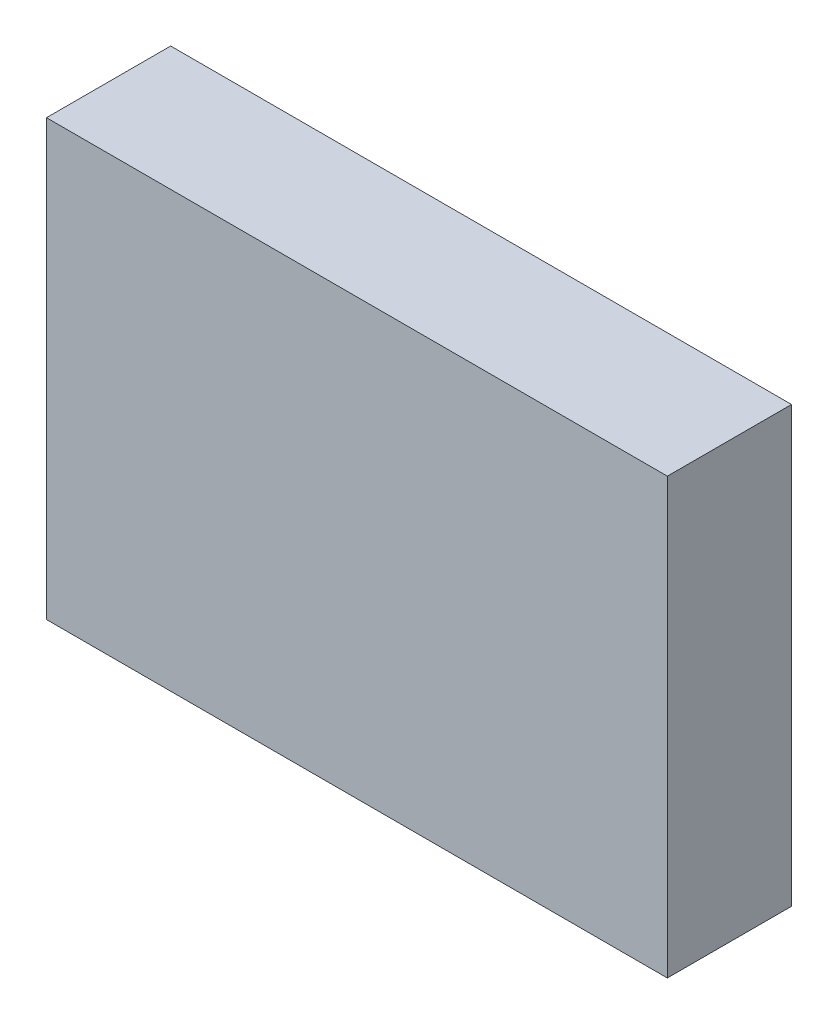
ISO-10303-21;
HEADER;
FILE_DESCRIPTION(('STEP AP214'),'2;1');
FILE_NAME('part.step','',(''),(''),'','','');
FILE_SCHEMA(('AUTOMOTIVE_DESIGN { 1 0 10303 214 1 1 1 1 }'));
ENDSEC;
DATA;
#1=APPLICATION_CONTEXT('core data for automotive mechanical design processes');
#2=APPLICATION_PROTOCOL_DEFINITION('international standard','automotive_design',2000,#1);
#3=PRODUCT_CONTEXT('',#1,'mechanical');
#4=PRODUCT('Part','Part','',(#3));
#5=PRODUCT_RELATED_PRODUCT_CATEGORY('part','',(#4));
#6=PRODUCT_DEFINITION_FORMATION('','',#4);
#7=PRODUCT_DEFINITION_CONTEXT('part definition',#1,'design');
#8=PRODUCT_DEFINITION('design','',#6,#7);
#9=PRODUCT_DEFINITION_SHAPE('','',#8);
#10=(LENGTH_UNIT() NAMED_UNIT(*) SI_UNIT(.MILLI.,.METRE.));
#11=(NAMED_UNIT(*) PLANE_ANGLE_UNIT() SI_UNIT($,.RADIAN.));
#12=(NAMED_UNIT(*) SI_UNIT($,.STERADIAN.) SOLID_ANGLE_UNIT());
#13=UNCERTAINTY_MEASURE_WITH_UNIT(LENGTH_MEASURE(1.E-05),#10,'distance_accuracy_value','');
#14=(GEOMETRIC_REPRESENTATION_CONTEXT(3) GLOBAL_UNCERTAINTY_ASSIGNED_CONTEXT((#13)) GLOBAL_UNIT_ASSIGNED_CONTEXT((#10,
#11,#12)) REPRESENTATION_CONTEXT('',''));
#15=CARTESIAN_POINT('',(0.,0.,0.));
#16=DIRECTION('',(0.,0.,1.));
#17=DIRECTION('',(1.,0.,0.));
#18=AXIS2_PLACEMENT_3D('',#15,#16,#17);
#19=CARTESIAN_POINT('',(0.,7.,0.));
#20=DIRECTION('',(1.,0.,0.));
#21=DIRECTION('',(0.,0.,-1.));
#22=AXIS2_PLACEMENT_3D('',#19,#20,#21);
#23=PLANE('',#22);
#24=DIRECTION('',(0.,0.,1.));
#25=VECTOR('',#24,1.);
#26=CARTESIAN_POINT('',(0.,0.,0.));
#27=LINE('',#26,#25);
#28=CARTESIAN_POINT('',(0.,0.,-2.));
#29=VERTEX_POINT('',#28);
#30=CARTESIAN_POINT('',(0.,0.,0.));
#31=VERTEX_POINT('',#30);
#32=EDGE_CURVE('E96',#29,#31,#27,.T.);
#33=ORIENTED_EDGE('',*,*,#32,.T.);
#34=DIRECTION('',(0.,-1.,0.));
#35=VECTOR('',#34,1.);
#36=CARTESIAN_POINT('',(0.,7.,0.));
#37=LINE('',#36,#35);
#38=CARTESIAN_POINT('',(0.,7.,0.));
#39=VERTEX_POINT('',#38);
#40=EDGE_CURVE('E11',#39,#31,#37,.T.);
#41=ORIENTED_EDGE('',*,*,#40,.F.);
#42=DIRECTION('',(0.,0.,1.));
#43=VECTOR('',#42,1.);
#44=CARTESIAN_POINT('',(0.,7.,0.));
#45=LINE('',#44,#43);
#46=CARTESIAN_POINT('',(0.,7.,-2.));
#47=VERTEX_POINT('',#46);
#48=EDGE_CURVE('E84',#47,#39,#45,.T.);
#49=ORIENTED_EDGE('',*,*,#48,.F.);
#50=DIRECTION('',(0.,-1.,0.));
#51=VECTOR('',#50,1.);
#52=CARTESIAN_POINT('',(0.,7.,-2.));
#53=LINE('',#52,#51);
#54=EDGE_CURVE('E92',#47,#29,#53,.T.);
#55=ORIENTED_EDGE('',*,*,#54,.T.);
#56=EDGE_LOOP('',(#33,#41,#49,#55));
#57=FACE_BOUND('',#56,.T.);
#58=ADVANCED_FACE('F33',(#57),#23,.F.);
#59=CARTESIAN_POINT('',(0.,7.,0.));
#60=DIRECTION('',(0.,0.,-1.));
#61=DIRECTION('',(-1.,0.,0.));
#62=AXIS2_PLACEMENT_3D('',#59,#60,#61);
#63=PLANE('',#62);
#64=DIRECTION('',(1.,0.,0.));
#65=VECTOR('',#64,1.);
#66=CARTESIAN_POINT('',(0.,0.,0.));
#67=LINE('',#66,#65);
#68=CARTESIAN_POINT('',(10.,0.,0.));
#69=VERTEX_POINT('',#68);
#70=EDGE_CURVE('E88',#31,#69,#67,.T.);
#71=ORIENTED_EDGE('',*,*,#70,.T.);
#72=DIRECTION('',(0.,-1.,0.));
#73=VECTOR('',#72,1.);
#74=CARTESIAN_POINT('',(10.,7.,0.));
#75=LINE('',#74,#73);
#76=CARTESIAN_POINT('',(10.,7.,0.));
#77=VERTEX_POINT('',#76);
#78=EDGE_CURVE('E41',#77,#69,#75,.T.);
#79=ORIENTED_EDGE('',*,*,#78,.F.);
#80=DIRECTION('',(1.,0.,0.));
#81=VECTOR('',#80,1.);
#82=CARTESIAN_POINT('',(0.,7.,0.));
#83=LINE('',#82,#81);
#84=EDGE_CURVE('E79',#39,#77,#83,.T.);
#85=ORIENTED_EDGE('',*,*,#84,.F.);
#86=ORIENTED_EDGE('',*,*,#40,.T.);
#87=EDGE_LOOP('',(#71,#79,#85,#86));
#88=FACE_BOUND('',#87,.T.);
#89=ADVANCED_FACE('F87',(#88),#63,.F.);
#90=CARTESIAN_POINT('',(10.,7.,0.));
#91=DIRECTION('',(-1.,0.,0.));
#92=DIRECTION('',(0.,0.,1.));
#93=AXIS2_PLACEMENT_3D('',#90,#91,#92);
#94=PLANE('',#93);
#95=DIRECTION('',(0.,0.,-1.));
#96=VECTOR('',#95,1.);
#97=CARTESIAN_POINT('',(10.,0.,0.));
#98=LINE('',#97,#96);
#99=CARTESIAN_POINT('',(10.,0.,-2.));
#100=VERTEX_POINT('',#99);
#101=EDGE_CURVE('E66',#69,#100,#98,.T.);
#102=ORIENTED_EDGE('',*,*,#101,.T.);
#103=DIRECTION('',(0.,-1.,0.));
#104=VECTOR('',#103,1.);
#105=CARTESIAN_POINT('',(10.,7.,-2.));
#106=LINE('',#105,#104);
#107=CARTESIAN_POINT('',(10.,7.,-2.));
#108=VERTEX_POINT('',#107);
#109=EDGE_CURVE('E89',#108,#100,#106,.T.);
#110=ORIENTED_EDGE('',*,*,#109,.F.);
#111=DIRECTION('',(0.,0.,-1.));
#112=VECTOR('',#111,1.);
#113=CARTESIAN_POINT('',(10.,7.,0.));
#114=LINE('',#113,#112);
#115=EDGE_CURVE('E82',#77,#108,#114,.T.);
#116=ORIENTED_EDGE('',*,*,#115,.F.);
#117=ORIENTED_EDGE('',*,*,#78,.T.);
#118=EDGE_LOOP('',(#102,#110,#116,#117));
#119=FACE_BOUND('',#118,.T.);
#120=ADVANCED_FACE('F90',(#119),#94,.F.);
#121=CARTESIAN_POINT('',(0.,7.,-2.));
#122=DIRECTION('',(0.,0.,1.));
#123=DIRECTION('',(1.,0.,0.));
#124=AXIS2_PLACEMENT_3D('',#121,#122,#123);
#125=PLANE('',#124);
#126=DIRECTION('',(-1.,0.,0.));
#127=VECTOR('',#126,1.);
#128=CARTESIAN_POINT('',(0.,0.,-2.));
#129=LINE('',#128,#127);
#130=EDGE_CURVE('E72',#100,#29,#129,.T.);
#131=ORIENTED_EDGE('',*,*,#130,.T.);
#132=ORIENTED_EDGE('',*,*,#54,.F.);
#133=DIRECTION('',(-1.,0.,0.));
#134=VECTOR('',#133,1.);
#135=CARTESIAN_POINT('',(0.,7.,-2.));
#136=LINE('',#135,#134);
#137=EDGE_CURVE('E49',#108,#47,#136,.T.);
#138=ORIENTED_EDGE('',*,*,#137,.F.);
#139=ORIENTED_EDGE('',*,*,#109,.T.);
#140=EDGE_LOOP('',(#131,#132,#138,#139));
#141=FACE_BOUND('',#140,.T.);
#142=ADVANCED_FACE('F103',(#141),#125,.F.);
#143=CARTESIAN_POINT('',(0.,7.,0.));
#144=DIRECTION('',(0.,-1.,0.));
#145=DIRECTION('',(0.,0.,-1.));
#146=AXIS2_PLACEMENT_3D('',#143,#144,#145);
#147=PLANE('',#146);
#148=ORIENTED_EDGE('',*,*,#48,.T.);
#149=ORIENTED_EDGE('',*,*,#84,.T.);
#150=ORIENTED_EDGE('',*,*,#115,.T.);
#151=ORIENTED_EDGE('',*,*,#137,.T.);
#152=EDGE_LOOP('',(#148,#149,#150,#151));
#153=FACE_BOUND('',#152,.T.);
#154=ADVANCED_FACE('F80',(#153),#147,.F.);
#155=CARTESIAN_POINT('',(0.,0.,0.));
#156=DIRECTION('',(0.,-1.,0.));
#157=DIRECTION('',(0.,0.,-1.));
#158=AXIS2_PLACEMENT_3D('',#155,#156,#157);
#159=PLANE('',#158);
#160=ORIENTED_EDGE('',*,*,#32,.F.);
#161=ORIENTED_EDGE('',*,*,#130,.F.);
#162=ORIENTED_EDGE('',*,*,#101,.F.);
#163=ORIENTED_EDGE('',*,*,#70,.F.);
#164=EDGE_LOOP('',(#160,#161,#162,#163));
#165=FACE_BOUND('',#164,.T.);
#166=ADVANCED_FACE('F106',(#165),#159,.T.);
#167=CLOSED_SHELL('',(#58,#89,#120,#142,#154,#166));
#168=MANIFOLD_SOLID_BREP('B2',#167);
#169=ADVANCED_BREP_SHAPE_REPRESENTATION('',(#18,#168),#14);
#170=SHAPE_DEFINITION_REPRESENTATION(#9,#169);
ENDSEC;
END-ISO-10303-21;
